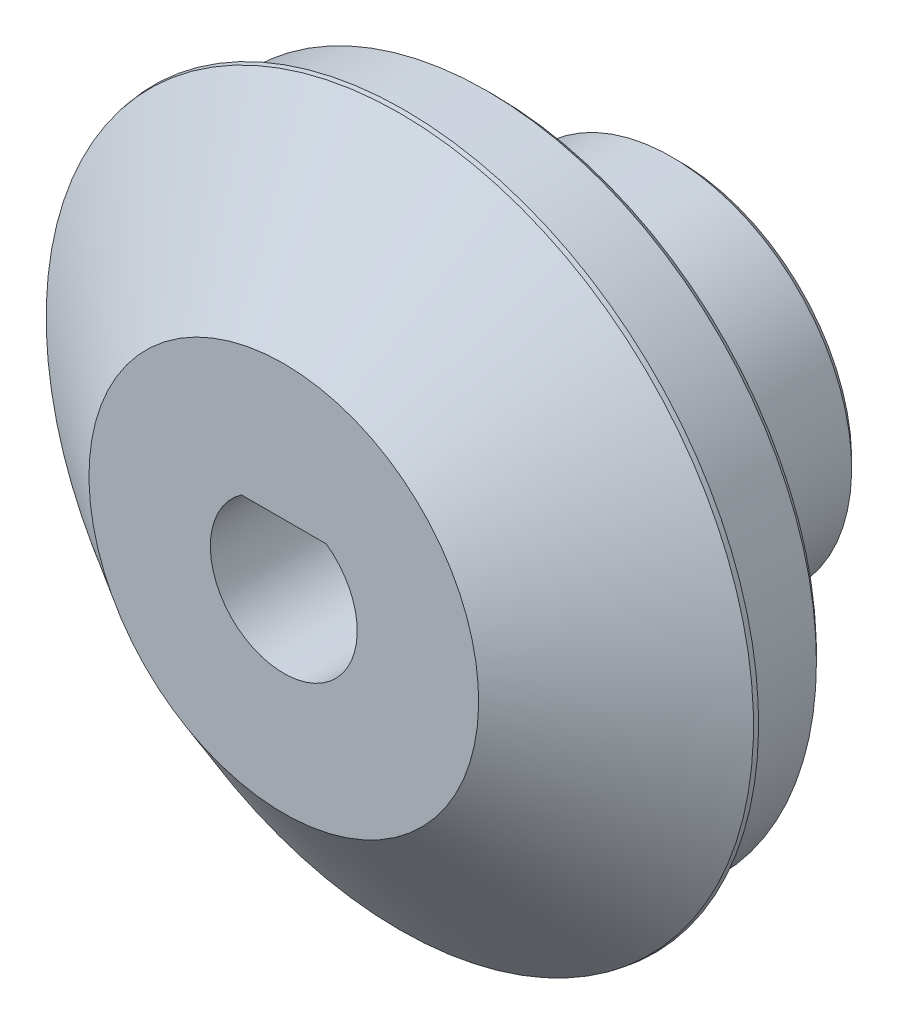
ISO-10303-21;
HEADER;
FILE_DESCRIPTION(('STEP AP214'),'2;1');
FILE_NAME('part.step','',(''),(''),'','','');
FILE_SCHEMA(('AUTOMOTIVE_DESIGN { 1 0 10303 214 1 1 1 1 }'));
ENDSEC;
DATA;
#1=APPLICATION_CONTEXT('core data for automotive mechanical design processes');
#2=APPLICATION_PROTOCOL_DEFINITION('international standard','automotive_design',2000,#1);
#3=PRODUCT_CONTEXT('',#1,'mechanical');
#4=PRODUCT('Part','Part','',(#3));
#5=PRODUCT_RELATED_PRODUCT_CATEGORY('part','',(#4));
#6=PRODUCT_DEFINITION_FORMATION('','',#4);
#7=PRODUCT_DEFINITION_CONTEXT('part definition',#1,'design');
#8=PRODUCT_DEFINITION('design','',#6,#7);
#9=PRODUCT_DEFINITION_SHAPE('','',#8);
#10=(LENGTH_UNIT() NAMED_UNIT(*) SI_UNIT(.MILLI.,.METRE.));
#11=(NAMED_UNIT(*) PLANE_ANGLE_UNIT() SI_UNIT($,.RADIAN.));
#12=(NAMED_UNIT(*) SI_UNIT($,.STERADIAN.) SOLID_ANGLE_UNIT());
#13=UNCERTAINTY_MEASURE_WITH_UNIT(LENGTH_MEASURE(1.E-05),#10,'distance_accuracy_value','');
#14=(GEOMETRIC_REPRESENTATION_CONTEXT(3) GLOBAL_UNCERTAINTY_ASSIGNED_CONTEXT((#13)) GLOBAL_UNIT_ASSIGNED_CONTEXT((#10,
#11,#12)) REPRESENTATION_CONTEXT('',''));
#15=CARTESIAN_POINT('',(0.,0.,0.));
#16=DIRECTION('',(0.,0.,1.));
#17=DIRECTION('',(1.,0.,0.));
#18=AXIS2_PLACEMENT_3D('',#15,#16,#17);
#19=CARTESIAN_POINT('',(0.,0.,-19.980893791572));
#20=DIRECTION('',(0.,0.,-1.));
#21=DIRECTION('',(0.,1.,0.));
#22=AXIS2_PLACEMENT_3D('',#19,#20,#21);
#23=PLANE('',#22);
#24=CARTESIAN_POINT('',(0.,0.,-19.980893791572));
#25=DIRECTION('',(0.,0.,-1.));
#26=DIRECTION('',(0.,1.,0.));
#27=AXIS2_PLACEMENT_3D('',#24,#25,#26);
#28=CIRCLE('',#27,6.5);
#29=CARTESIAN_POINT('',(0.,6.5,-19.980893791572));
#30=VERTEX_POINT('',#29);
#31=EDGE_CURVE('E87',#30,#30,#28,.T.);
#32=ORIENTED_EDGE('',*,*,#31,.F.);
#33=EDGE_LOOP('',(#32));
#34=FACE_BOUND('',#33,.T.);
#35=CARTESIAN_POINT('',(0.,0.,-19.980893791572));
#36=DIRECTION('',(0.,0.,-1.));
#37=DIRECTION('',(0.,1.,0.));
#38=AXIS2_PLACEMENT_3D('',#35,#36,#37);
#39=CIRCLE('',#38,2.45);
#40=CARTESIAN_POINT('',(1.41509716980849,2.,-19.980893791572));
#41=VERTEX_POINT('',#40);
#42=CARTESIAN_POINT('',(-1.41509716980849,2.,-19.980893791572));
#43=VERTEX_POINT('',#42);
#44=EDGE_CURVE('E79',#41,#43,#39,.T.);
#45=ORIENTED_EDGE('',*,*,#44,.T.);
#46=DIRECTION('',(1.,0.,0.));
#47=VECTOR('',#46,1.);
#48=CARTESIAN_POINT('',(0.,2.,-19.980893791572));
#49=LINE('',#48,#47);
#50=EDGE_CURVE('E88',#43,#41,#49,.T.);
#51=ORIENTED_EDGE('',*,*,#50,.T.);
#52=EDGE_LOOP('',(#45,#51));
#53=FACE_BOUND('',#52,.T.);
#54=ADVANCED_FACE('F38',(#34,#53),#23,.F.);
#55=CARTESIAN_POINT('',(0.,0.,-19.980893791572));
#56=DIRECTION('',(0.,0.,-1.));
#57=DIRECTION('',(0.,1.,0.));
#58=AXIS2_PLACEMENT_3D('',#55,#56,#57);
#59=CONICAL_SURFACE('',#58,6.5,0.939731702891748);
#60=CARTESIAN_POINT('',(0.,0.,-23.852498832674));
#61=DIRECTION('',(0.,0.,1.));
#62=DIRECTION('',(0.,-1.,0.));
#63=AXIS2_PLACEMENT_3D('',#60,#61,#62);
#64=CIRCLE('',#63,11.79815004177);
#65=CARTESIAN_POINT('',(0.,11.79815004177,-23.852498832674));
#66=VERTEX_POINT('',#65);
#67=EDGE_CURVE('E12',#66,#66,#64,.T.);
#68=ORIENTED_EDGE('',*,*,#67,.T.);
#69=EDGE_LOOP('',(#68));
#70=FACE_BOUND('',#69,.T.);
#71=ORIENTED_EDGE('',*,*,#31,.T.);
#72=EDGE_LOOP('',(#71));
#73=FACE_BOUND('',#72,.T.);
#74=ADVANCED_FACE('F148',(#70,#73),#59,.T.);
#75=CARTESIAN_POINT('',(0.,0.,-37.7656675749319));
#76=DIRECTION('',(0.,0.,-1.));
#77=DIRECTION('',(0.,1.,0.));
#78=AXIS2_PLACEMENT_3D('',#75,#76,#77);
#79=CYLINDRICAL_SURFACE('',#78,2.45);
#80=DIRECTION('',(0.,0.,-1.));
#81=VECTOR('',#80,1.);
#82=CARTESIAN_POINT('',(1.41509716980849,2.,-37.7656675749319));
#83=LINE('',#82,#81);
#84=CARTESIAN_POINT('',(1.41509716980849,2.,-32.9250000000001));
#85=VERTEX_POINT('',#84);
#86=EDGE_CURVE('E83',#41,#85,#83,.T.);
#87=ORIENTED_EDGE('',*,*,#86,.T.);
#88=CARTESIAN_POINT('',(0.,0.,-32.9250000000001));
#89=DIRECTION('',(0.,0.,1.));
#90=DIRECTION('',(0.,-1.,0.));
#91=AXIS2_PLACEMENT_3D('',#88,#89,#90);
#92=CIRCLE('',#91,2.45);
#93=CARTESIAN_POINT('',(-1.41509716980849,2.,-32.9250000000001));
#94=VERTEX_POINT('',#93);
#95=EDGE_CURVE('E66',#85,#94,#92,.F.);
#96=ORIENTED_EDGE('',*,*,#95,.T.);
#97=DIRECTION('',(0.,0.,-1.));
#98=VECTOR('',#97,1.);
#99=CARTESIAN_POINT('',(-1.41509716980849,2.,-19.980893791572));
#100=LINE('',#99,#98);
#101=EDGE_CURVE('E84',#43,#94,#100,.T.);
#102=ORIENTED_EDGE('',*,*,#101,.F.);
#103=ORIENTED_EDGE('',*,*,#44,.F.);
#104=EDGE_LOOP('',(#87,#96,#102,#103));
#105=FACE_BOUND('',#104,.T.);
#106=ADVANCED_FACE('F81',(#105),#79,.F.);
#107=CARTESIAN_POINT('',(0.,0.,-24.));
#108=DIRECTION('',(0.,0.,1.));
#109=DIRECTION('',(0.,-1.,0.));
#110=AXIS2_PLACEMENT_3D('',#107,#108,#109);
#111=PLANE('',#110);
#112=CARTESIAN_POINT('',(0.,0.,-24.));
#113=DIRECTION('',(0.,0.,1.));
#114=DIRECTION('',(0.,-1.,0.));
#115=AXIS2_PLACEMENT_3D('',#112,#113,#114);
#116=CIRCLE('',#115,11.8210968981407);
#117=CARTESIAN_POINT('',(0.,11.8210968981407,-24.));
#118=VERTEX_POINT('',#117);
#119=EDGE_CURVE('E52',#118,#118,#116,.F.);
#120=ORIENTED_EDGE('',*,*,#119,.T.);
#121=EDGE_LOOP('',(#120));
#122=FACE_BOUND('',#121,.T.);
#123=CARTESIAN_POINT('',(0.,0.,-24.));
#124=DIRECTION('',(0.,0.,-1.));
#125=DIRECTION('',(0.,1.,0.));
#126=AXIS2_PLACEMENT_3D('',#123,#124,#125);
#127=CIRCLE('',#126,11.);
#128=CARTESIAN_POINT('',(0.,11.,-24.));
#129=VERTEX_POINT('',#128);
#130=EDGE_CURVE('E99',#129,#129,#127,.T.);
#131=ORIENTED_EDGE('',*,*,#130,.F.);
#132=EDGE_LOOP('',(#131));
#133=FACE_BOUND('',#132,.T.);
#134=ADVANCED_FACE('F156',(#122,#133),#111,.F.);
#135=CARTESIAN_POINT('',(0.,0.,-37.7656675749319));
#136=DIRECTION('',(0.,0.,-1.));
#137=DIRECTION('',(0.,1.,0.));
#138=AXIS2_PLACEMENT_3D('',#135,#136,#137);
#139=CYLINDRICAL_SURFACE('',#138,11.);
#140=CARTESIAN_POINT('',(0.,0.,-26.75));
#141=DIRECTION('',(0.,0.,1.));
#142=DIRECTION('',(0.,-1.,0.));
#143=AXIS2_PLACEMENT_3D('',#140,#141,#142);
#144=CIRCLE('',#143,11.);
#145=CARTESIAN_POINT('',(0.,-11.,-26.75));
#146=VERTEX_POINT('',#145);
#147=EDGE_CURVE('E108',#146,#146,#144,.T.);
#148=ORIENTED_EDGE('',*,*,#147,.T.);
#149=EDGE_LOOP('',(#148));
#150=FACE_BOUND('',#149,.T.);
#151=ORIENTED_EDGE('',*,*,#130,.T.);
#152=EDGE_LOOP('',(#151));
#153=FACE_BOUND('',#152,.T.);
#154=ADVANCED_FACE('F165',(#150,#153),#139,.T.);
#155=CARTESIAN_POINT('',(0.,0.,-27.));
#156=DIRECTION('',(0.,0.,1.));
#157=DIRECTION('',(0.,-1.,0.));
#158=AXIS2_PLACEMENT_3D('',#155,#156,#157);
#159=PLANE('',#158);
#160=CARTESIAN_POINT('',(0.,0.,-27.));
#161=DIRECTION('',(0.,0.,1.));
#162=DIRECTION('',(0.,-1.,0.));
#163=AXIS2_PLACEMENT_3D('',#160,#161,#162);
#164=CIRCLE('',#163,10.75);
#165=CARTESIAN_POINT('',(0.,-10.75,-27.));
#166=VERTEX_POINT('',#165);
#167=EDGE_CURVE('E105',#166,#166,#164,.F.);
#168=ORIENTED_EDGE('',*,*,#167,.T.);
#169=EDGE_LOOP('',(#168));
#170=FACE_BOUND('',#169,.T.);
#171=CARTESIAN_POINT('',(0.,0.,-27.));
#172=DIRECTION('',(0.,0.,1.));
#173=DIRECTION('',(0.,-1.,0.));
#174=AXIS2_PLACEMENT_3D('',#171,#172,#173);
#175=CIRCLE('',#174,6.25000000002338);
#176=CARTESIAN_POINT('',(0.,-6.25000000002338,-27.));
#177=VERTEX_POINT('',#176);
#178=EDGE_CURVE('E102',#177,#177,#175,.T.);
#179=ORIENTED_EDGE('',*,*,#178,.T.);
#180=EDGE_LOOP('',(#179));
#181=FACE_BOUND('',#180,.T.);
#182=ADVANCED_FACE('F169',(#170,#181),#159,.F.);
#183=CARTESIAN_POINT('',(0.,0.,-37.7656675749319));
#184=DIRECTION('',(0.,0.,-1.));
#185=DIRECTION('',(0.,1.,0.));
#186=AXIS2_PLACEMENT_3D('',#183,#184,#185);
#187=CYLINDRICAL_SURFACE('',#186,6.00000000002338);
#188=CARTESIAN_POINT('',(0.,0.,-27.25));
#189=DIRECTION('',(0.,0.,1.));
#190=DIRECTION('',(0.,-1.,0.));
#191=AXIS2_PLACEMENT_3D('',#188,#189,#190);
#192=CIRCLE('',#191,6.00000000002338);
#193=CARTESIAN_POINT('',(0.,-6.00000000002338,-27.25));
#194=VERTEX_POINT('',#193);
#195=EDGE_CURVE('E114',#194,#194,#192,.F.);
#196=ORIENTED_EDGE('',*,*,#195,.T.);
#197=EDGE_LOOP('',(#196));
#198=FACE_BOUND('',#197,.T.);
#199=CARTESIAN_POINT('',(0.,0.,-32.9250000000001));
#200=DIRECTION('',(0.,0.,1.));
#201=DIRECTION('',(0.,-1.,0.));
#202=AXIS2_PLACEMENT_3D('',#199,#200,#201);
#203=CIRCLE('',#202,6.00000000002338);
#204=CARTESIAN_POINT('',(0.,-6.00000000002338,-32.9250000000001));
#205=VERTEX_POINT('',#204);
#206=EDGE_CURVE('E111',#205,#205,#203,.T.);
#207=ORIENTED_EDGE('',*,*,#206,.T.);
#208=EDGE_LOOP('',(#207));
#209=FACE_BOUND('',#208,.T.);
#210=ADVANCED_FACE('F173',(#198,#209),#187,.T.);
#211=CARTESIAN_POINT('',(0.,0.,-33.1750000000001));
#212=DIRECTION('',(0.,0.,1.));
#213=DIRECTION('',(0.,-1.,0.));
#214=AXIS2_PLACEMENT_3D('',#211,#212,#213);
#215=PLANE('',#214);
#216=CARTESIAN_POINT('',(0.,0.,-33.1750000000001));
#217=DIRECTION('',(0.,0.,1.));
#218=DIRECTION('',(0.,-1.,0.));
#219=AXIS2_PLACEMENT_3D('',#216,#217,#218);
#220=CIRCLE('',#219,5.75000000002339);
#221=CARTESIAN_POINT('',(0.,-5.75000000002339,-33.1750000000001));
#222=VERTEX_POINT('',#221);
#223=EDGE_CURVE('E122',#222,#222,#220,.F.);
#224=ORIENTED_EDGE('',*,*,#223,.T.);
#225=EDGE_LOOP('',(#224));
#226=FACE_BOUND('',#225,.T.);
#227=CARTESIAN_POINT('',(0.,0.,-33.1750000000001));
#228=DIRECTION('',(0.,0.,1.));
#229=DIRECTION('',(0.,-1.,0.));
#230=AXIS2_PLACEMENT_3D('',#227,#228,#229);
#231=CIRCLE('',#230,2.7);
#232=CARTESIAN_POINT('',(-1.4924811556601,2.24999999999989,-33.1750000000001));
#233=VERTEX_POINT('',#232);
#234=CARTESIAN_POINT('',(1.4924811556601,2.24999999999989,-33.1750000000001));
#235=VERTEX_POINT('',#234);
#236=EDGE_CURVE('E117',#233,#235,#231,.T.);
#237=ORIENTED_EDGE('',*,*,#236,.T.);
#238=DIRECTION('',(-1.,0.,0.));
#239=VECTOR('',#238,1.);
#240=CARTESIAN_POINT('',(-1.41509716980849,2.25,-33.1750000000001));
#241=LINE('',#240,#239);
#242=EDGE_CURVE('E119',#235,#233,#241,.T.);
#243=ORIENTED_EDGE('',*,*,#242,.T.);
#244=EDGE_LOOP('',(#237,#243));
#245=FACE_BOUND('',#244,.T.);
#246=ADVANCED_FACE('F177',(#226,#245),#215,.F.);
#247=CARTESIAN_POINT('',(0.,2.,-16.9395125264229));
#248=DIRECTION('',(0.,-1.,0.));
#249=DIRECTION('',(0.,0.,-1.));
#250=AXIS2_PLACEMENT_3D('',#247,#248,#249);
#251=PLANE('',#250);
#252=ORIENTED_EDGE('',*,*,#101,.T.);
#253=DIRECTION('',(1.,0.,0.));
#254=VECTOR('',#253,1.);
#255=CARTESIAN_POINT('',(1.41509716980849,2.,-32.9250000000001));
#256=LINE('',#255,#254);
#257=EDGE_CURVE('E94',#94,#85,#256,.T.);
#258=ORIENTED_EDGE('',*,*,#257,.T.);
#259=ORIENTED_EDGE('',*,*,#86,.F.);
#260=ORIENTED_EDGE('',*,*,#50,.F.);
#261=EDGE_LOOP('',(#252,#258,#259,#260));
#262=FACE_BOUND('',#261,.T.);
#263=ADVANCED_FACE('F93',(#262),#251,.T.);
#264=CARTESIAN_POINT('',(0.,0.,-27.));
#265=DIRECTION('',(0.,0.,1.));
#266=DIRECTION('',(0.,-1.,0.));
#267=AXIS2_PLACEMENT_3D('',#264,#265,#266);
#268=CONICAL_SURFACE('',#267,10.75,0.785398163397455);
#269=ORIENTED_EDGE('',*,*,#147,.F.);
#270=EDGE_LOOP('',(#269));
#271=FACE_BOUND('',#270,.T.);
#272=ORIENTED_EDGE('',*,*,#167,.F.);
#273=EDGE_LOOP('',(#272));
#274=FACE_BOUND('',#273,.T.);
#275=ADVANCED_FACE('F182',(#271,#274),#268,.T.);
#276=CARTESIAN_POINT('',(0.,0.,-27.25));
#277=DIRECTION('',(0.,0.,1.));
#278=DIRECTION('',(0.,-1.,0.));
#279=AXIS2_PLACEMENT_3D('',#276,#277,#278);
#280=CONICAL_SURFACE('',#279,6.00000000002338,0.78539816339745);
#281=ORIENTED_EDGE('',*,*,#178,.F.);
#282=EDGE_LOOP('',(#281));
#283=FACE_BOUND('',#282,.T.);
#284=ORIENTED_EDGE('',*,*,#195,.F.);
#285=EDGE_LOOP('',(#284));
#286=FACE_BOUND('',#285,.T.);
#287=ADVANCED_FACE('F145',(#283,#286),#280,.T.);
#288=CARTESIAN_POINT('',(0.,0.,-33.1750000000001));
#289=DIRECTION('',(0.,0.,1.));
#290=DIRECTION('',(0.,-1.,0.));
#291=AXIS2_PLACEMENT_3D('',#288,#289,#290);
#292=CONICAL_SURFACE('',#291,5.75000000002339,0.785398163397443);
#293=ORIENTED_EDGE('',*,*,#206,.F.);
#294=EDGE_LOOP('',(#293));
#295=FACE_BOUND('',#294,.T.);
#296=ORIENTED_EDGE('',*,*,#223,.F.);
#297=EDGE_LOOP('',(#296));
#298=FACE_BOUND('',#297,.T.);
#299=ADVANCED_FACE('F138',(#295,#298),#292,.T.);
#300=CARTESIAN_POINT('',(0.,0.,-32.9250000000001));
#301=DIRECTION('',(0.,0.,-1.));
#302=DIRECTION('',(0.,1.,0.));
#303=AXIS2_PLACEMENT_3D('',#300,#301,#302);
#304=CONICAL_SURFACE('',#303,2.45,0.78539816339745);
#305=CARTESIAN_POINT('',(-1.49248115566018,2.25,-33.1750000000001));
#306=CARTESIAN_POINT('',(-1.47991134128337,2.20828266062823,-33.1332826606283));
#307=CARTESIAN_POINT('',(-1.46717777108712,2.16659066541237,-33.0915906654124));
#308=CARTESIAN_POINT('',(-1.4413831093823,2.083257332041,-33.008257332041));
#309=CARTESIAN_POINT('',(-1.42832201762808,2.04161599392352,-32.9666159939236));
#310=CARTESIAN_POINT('',(-1.41509716980877,1.99999999999996,-32.925));
#311=B_SPLINE_CURVE_WITH_KNOTS('',3,(#305,#306,#307,#308,#309,#310),.UNSPECIFIED.,.F.,.F.,(4,2,
4),(0.,0.180962147038884,0.361924429805674),.UNSPECIFIED.);
#312=EDGE_CURVE('E97',#94,#233,#311,.F.);
#313=ORIENTED_EDGE('',*,*,#312,.F.);
#314=ORIENTED_EDGE('',*,*,#95,.F.);
#315=CARTESIAN_POINT('',(1.41509716980849,2.,-32.9250000000001));
#316=CARTESIAN_POINT('',(1.42832201762792,2.04161599392354,-32.9666159939236));
#317=CARTESIAN_POINT('',(1.44138310938223,2.08325733204101,-33.0082573320411));
#318=CARTESIAN_POINT('',(1.46717777108718,2.16659066541236,-33.0915906654124));
#319=CARTESIAN_POINT('',(1.47991134128346,2.20828266062822,-33.1332826606283));
#320=CARTESIAN_POINT('',(1.49248115566027,2.24999999999999,-33.175));
#321=B_SPLINE_CURVE_WITH_KNOTS('',3,(#315,#316,#317,#318,#319,#320),.UNSPECIFIED.,.F.,.F.,(4,2,
4),(0.,0.180962282766793,0.361924429805678),.UNSPECIFIED.);
#322=EDGE_CURVE('E42',#235,#85,#321,.F.);
#323=ORIENTED_EDGE('',*,*,#322,.F.);
#324=ORIENTED_EDGE('',*,*,#236,.F.);
#325=EDGE_LOOP('',(#313,#314,#323,#324));
#326=FACE_BOUND('',#325,.T.);
#327=ADVANCED_FACE('F135',(#326),#304,.F.);
#328=CARTESIAN_POINT('',(0.,2.25,-33.1750000000001));
#329=DIRECTION('',(0.,-0.707106781186546,-0.707106781186549));
#330=DIRECTION('',(1.,0.,0.));
#331=AXIS2_PLACEMENT_3D('',#328,#329,#330);
#332=PLANE('',#331);
#333=ORIENTED_EDGE('',*,*,#322,.T.);
#334=ORIENTED_EDGE('',*,*,#257,.F.);
#335=ORIENTED_EDGE('',*,*,#312,.T.);
#336=ORIENTED_EDGE('',*,*,#242,.F.);
#337=EDGE_LOOP('',(#333,#334,#335,#336));
#338=FACE_BOUND('',#337,.T.);
#339=ADVANCED_FACE('F132',(#338),#332,.T.);
#340=CARTESIAN_POINT('',(0.,0.,-24.));
#341=DIRECTION('',(0.,0.,-1.));
#342=DIRECTION('',(0.,1.,0.));
#343=AXIS2_PLACEMENT_3D('',#340,#341,#342);
#344=CONICAL_SURFACE('',#343,11.8210968981407,0.154333539494309);
#345=CARTESIAN_POINT('',(0.,11.79815004177,-23.852498832674));
#346=CARTESIAN_POINT('',(0.,11.7983890715238,-23.854035303167));
#347=CARTESIAN_POINT('',(0.,11.7986281012777,-23.85557177366));
#348=CARTESIAN_POINT('',(0.,11.7991061607854,-23.8586447146459));
#349=CARTESIAN_POINT('',(0.,11.7993451905393,-23.8601811851389));
#350=CARTESIAN_POINT('',(0.,11.799823250047,-23.8632541261249));
#351=CARTESIAN_POINT('',(0.,11.8000622798009,-23.8647905966178));
#352=CARTESIAN_POINT('',(0.,11.8005403393086,-23.8678635376038));
#353=CARTESIAN_POINT('',(0.,11.8007793690625,-23.8694000080968));
#354=CARTESIAN_POINT('',(0.,11.8012574285702,-23.8724729490827));
#355=CARTESIAN_POINT('',(0.,11.801496458324,-23.8740094195757));
#356=CARTESIAN_POINT('',(0.,11.8019745178318,-23.8770823605617));
#357=CARTESIAN_POINT('',(0.,11.8022135475856,-23.8786188310546));
#358=CARTESIAN_POINT('',(0.,11.8026916070934,-23.8816917720406));
#359=CARTESIAN_POINT('',(0.,11.8029306368472,-23.8832282425336));
#360=CARTESIAN_POINT('',(0.,11.8034086963549,-23.8863011835195));
#361=CARTESIAN_POINT('',(0.,11.8036477261088,-23.8878376540125));
#362=CARTESIAN_POINT('',(0.,11.8041257856165,-23.8909105949985));
#363=CARTESIAN_POINT('',(0.,11.8043648153704,-23.8924470654915));
#364=CARTESIAN_POINT('',(0.,11.8048428748781,-23.8955200064774));
#365=CARTESIAN_POINT('',(0.,11.805081904632,-23.8970564769704));
#366=CARTESIAN_POINT('',(0.,11.8055599641397,-23.9001294179564));
#367=CARTESIAN_POINT('',(0.,11.8057989938936,-23.9016658884493));
#368=CARTESIAN_POINT('',(0.,11.8062770534013,-23.9047388294353));
#369=CARTESIAN_POINT('',(0.,11.8065160831552,-23.9062752999283));
#370=CARTESIAN_POINT('',(0.,11.8069941426629,-23.9093482409142));
#371=CARTESIAN_POINT('',(0.,11.8072331724167,-23.9108847114072));
#372=CARTESIAN_POINT('',(0.,11.8077112319245,-23.9139576523932));
#373=CARTESIAN_POINT('',(0.,11.8079502616783,-23.9154941228862));
#374=CARTESIAN_POINT('',(0.,11.808428321186,-23.9185670638721));
#375=CARTESIAN_POINT('',(0.,11.8086673509399,-23.9201035343651));
#376=CARTESIAN_POINT('',(0.,11.8091454104476,-23.9231764753511));
#377=CARTESIAN_POINT('',(0.,11.8093844402015,-23.924712945844));
#378=CARTESIAN_POINT('',(0.,11.8098624997092,-23.92778588683));
#379=CARTESIAN_POINT('',(0.,11.8101015294631,-23.929322357323));
#380=CARTESIAN_POINT('',(0.,11.8105795889708,-23.9323952983089));
#381=CARTESIAN_POINT('',(0.,11.8108186187247,-23.9339317688019));
#382=CARTESIAN_POINT('',(0.,11.8112966782324,-23.9370047097879));
#383=CARTESIAN_POINT('',(0.,11.8115357079863,-23.9385411802808));
#384=CARTESIAN_POINT('',(0.,11.812013767494,-23.9416141212668));
#385=CARTESIAN_POINT('',(0.,11.8122527972478,-23.9431505917598));
#386=CARTESIAN_POINT('',(0.,11.8127308567556,-23.9462235327457));
#387=CARTESIAN_POINT('',(0.,11.8129698865094,-23.9477600032387));
#388=CARTESIAN_POINT('',(0.,11.8134479460171,-23.9508329442247));
#389=CARTESIAN_POINT('',(0.,11.813686975771,-23.9523694147177));
#390=CARTESIAN_POINT('',(0.,11.8141650352787,-23.9554423557036));
#391=CARTESIAN_POINT('',(0.,11.8144040650326,-23.9569788261966));
#392=CARTESIAN_POINT('',(0.,11.8148821245403,-23.9600517671826));
#393=CARTESIAN_POINT('',(0.,11.8151211542942,-23.9615882376755));
#394=CARTESIAN_POINT('',(0.,11.8155992138019,-23.9646611786615));
#395=CARTESIAN_POINT('',(0.,11.8158382435558,-23.9661976491545));
#396=CARTESIAN_POINT('',(0.,11.8163163030635,-23.9692705901404));
#397=CARTESIAN_POINT('',(0.,11.8165553328174,-23.9708070606334));
#398=CARTESIAN_POINT('',(0.,11.8170333923251,-23.9738800016194));
#399=CARTESIAN_POINT('',(0.,11.8172724220789,-23.9754164721124));
#400=CARTESIAN_POINT('',(0.,11.8177504815867,-23.9784894130983));
#401=CARTESIAN_POINT('',(0.,11.8179895113405,-23.9800258835913));
#402=CARTESIAN_POINT('',(0.,11.8184675708483,-23.9830988245773));
#403=CARTESIAN_POINT('',(0.,11.8187066006021,-23.9846352950702));
#404=CARTESIAN_POINT('',(0.,11.8191846601098,-23.9877082360562));
#405=CARTESIAN_POINT('',(0.,11.8194236898637,-23.9892447065492));
#406=CARTESIAN_POINT('',(0.,11.8199017493714,-23.9923176475351));
#407=CARTESIAN_POINT('',(0.,11.8201407791253,-23.9938541180281));
#408=CARTESIAN_POINT('',(0.,11.820618838633,-23.9969270590141));
#409=CARTESIAN_POINT('',(0.,11.8208578683869,-23.998463529507));
#410=CARTESIAN_POINT('',(0.,11.8210968981407,-24.));
#411=B_SPLINE_CURVE_WITH_KNOTS('',3,(#345,#346,#347,#348,#349,#350,#351,#352,#353,#354,#355,
#356,#357,#358,#359,#360,#361,#362,#363,#364,#365,#366,#367,#368,#369,#370,#371,#372,#373,#374,
#375,#376,#377,#378,#379,#380,#381,#382,#383,#384,#385,#386,#387,#388,#389,#390,#391,#392,#393,
#394,#395,#396,#397,#398,#399,#400,#401,#402,#403,#404,#405,#406,#407,#408,#409,#410),
.UNSPECIFIED.,.F.,.F.,(4,2,2,2,2,2,2,2,2,2,2,2,2,2,2,2,2,2,2,2,2,2,2,2,2,2,2,2,2,2,2,2,4),(0.,
0.00466485703867072,0.00932971407734171,0.0139945711160161,0.0186594281546868,
0.0233242851933613,0.0279891422320322,0.0326539992707064,0.0373188563093774,0.0419837133480515,
0.0466485703867225,0.0513134274253969,0.0559782844640677,0.0606431415027421,0.0653079985414131,
0.0699728555800872,0.0746377126187582,0.0793025696574289,0.0839674266961033,0.0886322837347743,
0.0932971407734485,0.0979619978121195,0.102626854850794,0.107291711889465,0.111956568928139,
0.11662142596681,0.121286283005484,0.125951140044155,0.130615997082829,0.1352808541215,
0.139945711160175,0.144610568198845,0.14927542523752),.UNSPECIFIED.);
#412=EDGE_CURVE('BSEAM40',#66,#118,#411,.T.);
#413=ORIENTED_EDGE('',*,*,#67,.F.);
#414=ORIENTED_EDGE('',*,*,#119,.F.);
#415=ORIENTED_EDGE('',*,*,#412,.T.);
#416=ORIENTED_EDGE('',*,*,#412,.F.);
#417=EDGE_LOOP('',(#413,#415,#414,#416));
#418=FACE_BOUND('',#417,.T.);
#419=ADVANCED_FACE('F40',(#418),#344,.T.);
#420=CLOSED_SHELL('',(#54,#74,#106,#134,#154,#182,#210,#246,#263,#275,#287,#299,#327,#339,#419));
#421=MANIFOLD_SOLID_BREP('B2',#420);
#422=ADVANCED_BREP_SHAPE_REPRESENTATION('',(#18,#421),#14);
#423=SHAPE_DEFINITION_REPRESENTATION(#9,#422);
ENDSEC;
END-ISO-10303-21;
